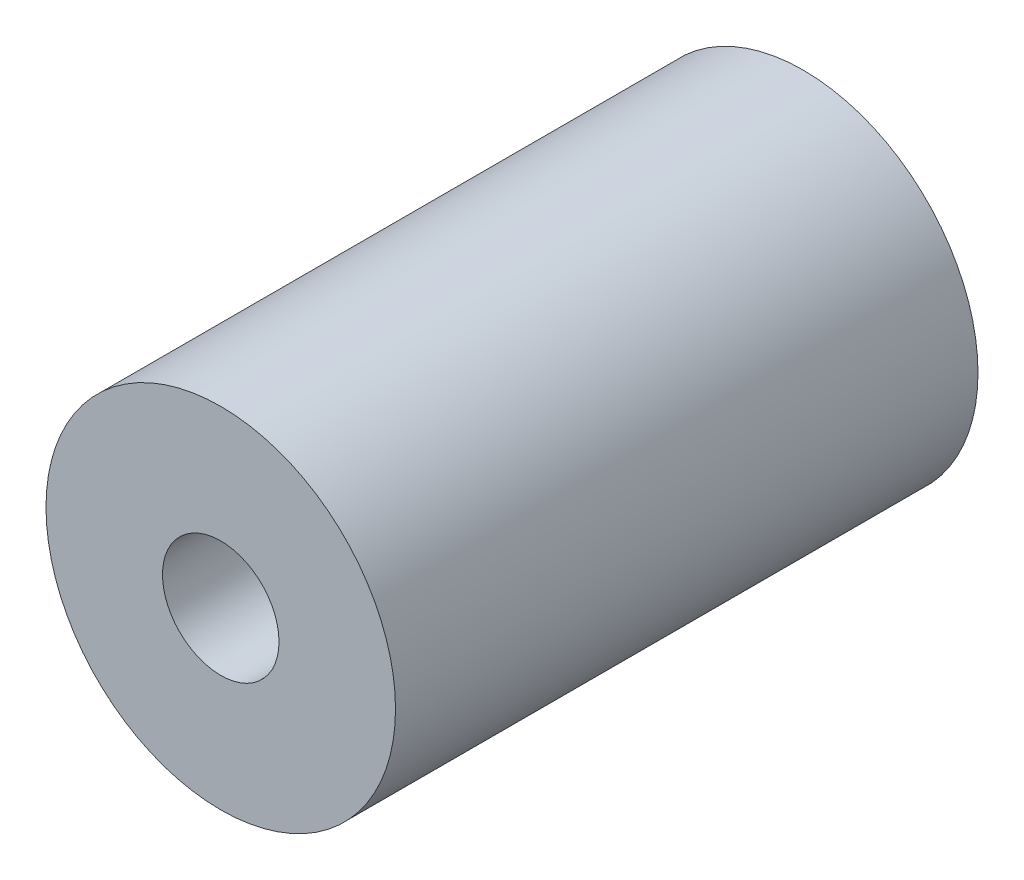
ISO-10303-21;
HEADER;
FILE_DESCRIPTION(('STEP AP214'),'2;1');
FILE_NAME('part.step','',(''),(''),'','','');
FILE_SCHEMA(('AUTOMOTIVE_DESIGN { 1 0 10303 214 1 1 1 1 }'));
ENDSEC;
DATA;
#1=APPLICATION_CONTEXT('core data for automotive mechanical design processes');
#2=APPLICATION_PROTOCOL_DEFINITION('international standard','automotive_design',2000,#1);
#3=PRODUCT_CONTEXT('',#1,'mechanical');
#4=PRODUCT('Part','Part','',(#3));
#5=PRODUCT_RELATED_PRODUCT_CATEGORY('part','',(#4));
#6=PRODUCT_DEFINITION_FORMATION('','',#4);
#7=PRODUCT_DEFINITION_CONTEXT('part definition',#1,'design');
#8=PRODUCT_DEFINITION('design','',#6,#7);
#9=PRODUCT_DEFINITION_SHAPE('','',#8);
#10=(LENGTH_UNIT() NAMED_UNIT(*) SI_UNIT(.MILLI.,.METRE.));
#11=(NAMED_UNIT(*) PLANE_ANGLE_UNIT() SI_UNIT($,.RADIAN.));
#12=(NAMED_UNIT(*) SI_UNIT($,.STERADIAN.) SOLID_ANGLE_UNIT());
#13=UNCERTAINTY_MEASURE_WITH_UNIT(LENGTH_MEASURE(1.E-05),#10,'distance_accuracy_value','');
#14=(GEOMETRIC_REPRESENTATION_CONTEXT(3) GLOBAL_UNCERTAINTY_ASSIGNED_CONTEXT((#13)) GLOBAL_UNIT_ASSIGNED_CONTEXT((#10,
#11,#12)) REPRESENTATION_CONTEXT('',''));
#15=CARTESIAN_POINT('',(0.,0.,0.));
#16=DIRECTION('',(0.,0.,1.));
#17=DIRECTION('',(1.,0.,0.));
#18=AXIS2_PLACEMENT_3D('',#15,#16,#17);
#19=CARTESIAN_POINT('',(0.,0.,100.));
#20=DIRECTION('',(0.,0.,1.));
#21=DIRECTION('',(1.,0.,0.));
#22=AXIS2_PLACEMENT_3D('',#19,#20,#21);
#23=PLANE('',#22);
#24=CARTESIAN_POINT('',(0.,0.,100.));
#25=DIRECTION('',(0.,0.,1.));
#26=DIRECTION('',(1.,0.,0.));
#27=AXIS2_PLACEMENT_3D('',#24,#25,#26);
#28=CIRCLE('',#27,30.);
#29=CARTESIAN_POINT('',(30.,0.,100.));
#30=VERTEX_POINT('',#29);
#31=EDGE_CURVE('E12',#30,#30,#28,.T.);
#32=ORIENTED_EDGE('',*,*,#31,.T.);
#33=EDGE_LOOP('',(#32));
#34=FACE_BOUND('',#33,.T.);
#35=CARTESIAN_POINT('',(0.,0.,100.));
#36=DIRECTION('',(0.,0.,1.));
#37=DIRECTION('',(1.,0.,0.));
#38=AXIS2_PLACEMENT_3D('',#35,#36,#37);
#39=CIRCLE('',#38,10.);
#40=CARTESIAN_POINT('',(10.,0.,100.));
#41=VERTEX_POINT('',#40);
#42=EDGE_CURVE('E52',#41,#41,#39,.T.);
#43=ORIENTED_EDGE('',*,*,#42,.F.);
#44=EDGE_LOOP('',(#43));
#45=FACE_BOUND('',#44,.T.);
#46=ADVANCED_FACE('F41',(#34,#45),#23,.T.);
#47=CARTESIAN_POINT('',(0.,0.,0.));
#48=DIRECTION('',(0.,0.,1.));
#49=DIRECTION('',(1.,0.,0.));
#50=AXIS2_PLACEMENT_3D('',#47,#48,#49);
#51=PLANE('',#50);
#52=CARTESIAN_POINT('',(0.,0.,0.));
#53=DIRECTION('',(0.,0.,1.));
#54=DIRECTION('',(1.,0.,0.));
#55=AXIS2_PLACEMENT_3D('',#52,#53,#54);
#56=CIRCLE('',#55,30.);
#57=CARTESIAN_POINT('',(30.,0.,0.));
#58=VERTEX_POINT('',#57);
#59=EDGE_CURVE('E45',#58,#58,#56,.T.);
#60=ORIENTED_EDGE('',*,*,#59,.F.);
#61=EDGE_LOOP('',(#60));
#62=FACE_BOUND('',#61,.T.);
#63=CARTESIAN_POINT('',(0.,0.,0.));
#64=DIRECTION('',(0.,0.,1.));
#65=DIRECTION('',(1.,0.,0.));
#66=AXIS2_PLACEMENT_3D('',#63,#64,#65);
#67=CIRCLE('',#66,10.);
#68=CARTESIAN_POINT('',(10.,0.,0.));
#69=VERTEX_POINT('',#68);
#70=EDGE_CURVE('E54',#69,#69,#67,.T.);
#71=ORIENTED_EDGE('',*,*,#70,.T.);
#72=EDGE_LOOP('',(#71));
#73=FACE_BOUND('',#72,.T.);
#74=ADVANCED_FACE('F64',(#62,#73),#51,.F.);
#75=CARTESIAN_POINT('',(0.,0.,100.));
#76=DIRECTION('',(0.,0.,-1.));
#77=DIRECTION('',(-1.,0.,0.));
#78=AXIS2_PLACEMENT_3D('',#75,#76,#77);
#79=CYLINDRICAL_SURFACE('',#78,30.);
#80=ORIENTED_EDGE('',*,*,#31,.F.);
#81=EDGE_LOOP('',(#80));
#82=FACE_BOUND('',#81,.T.);
#83=ORIENTED_EDGE('',*,*,#59,.T.);
#84=EDGE_LOOP('',(#83));
#85=FACE_BOUND('',#84,.T.);
#86=ADVANCED_FACE('F43',(#82,#85),#79,.T.);
#87=CARTESIAN_POINT('',(0.,0.,100.));
#88=DIRECTION('',(0.,0.,-1.));
#89=DIRECTION('',(-1.,0.,0.));
#90=AXIS2_PLACEMENT_3D('',#87,#88,#89);
#91=CYLINDRICAL_SURFACE('',#90,10.);
#92=ORIENTED_EDGE('',*,*,#42,.T.);
#93=EDGE_LOOP('',(#92));
#94=FACE_BOUND('',#93,.T.);
#95=ORIENTED_EDGE('',*,*,#70,.F.);
#96=EDGE_LOOP('',(#95));
#97=FACE_BOUND('',#96,.T.);
#98=ADVANCED_FACE('F60',(#94,#97),#91,.F.);
#99=CLOSED_SHELL('',(#46,#74,#86,#98));
#100=MANIFOLD_SOLID_BREP('B2',#99);
#101=ADVANCED_BREP_SHAPE_REPRESENTATION('',(#18,#100),#14);
#102=SHAPE_DEFINITION_REPRESENTATION(#9,#101);
ENDSEC;
END-ISO-10303-21;
